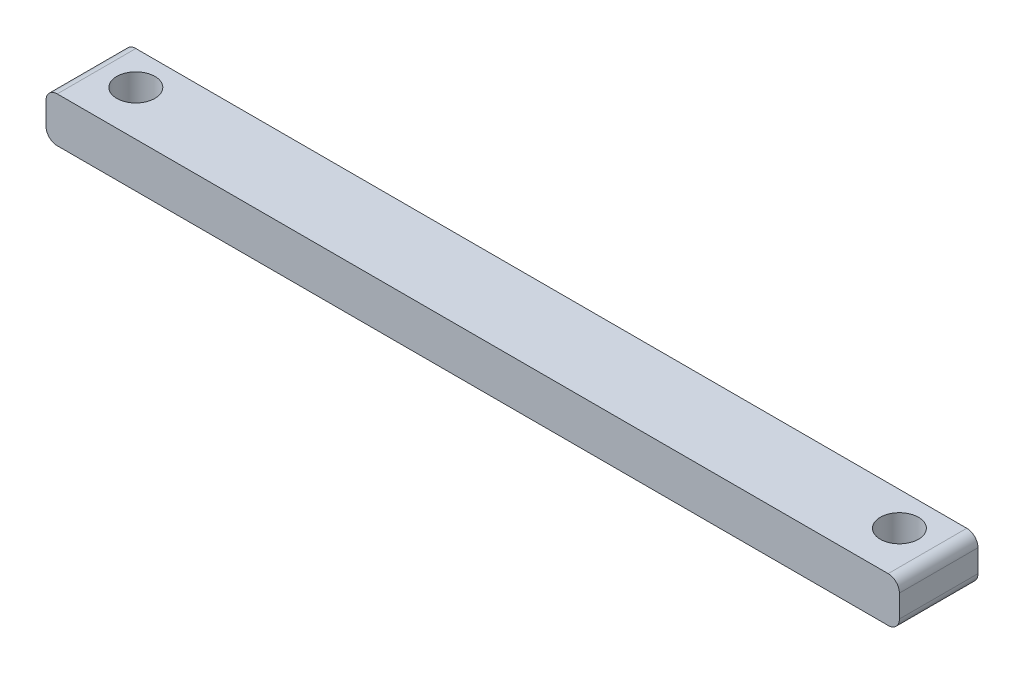
ISO-10303-21;
HEADER;
FILE_DESCRIPTION(('STEP AP214'),'2;1');
FILE_NAME('part.step','',(''),(''),'','','');
FILE_SCHEMA(('AUTOMOTIVE_DESIGN { 1 0 10303 214 1 1 1 1 }'));
ENDSEC;
DATA;
#1=APPLICATION_CONTEXT('core data for automotive mechanical design processes');
#2=APPLICATION_PROTOCOL_DEFINITION('international standard','automotive_design',2000,#1);
#3=PRODUCT_CONTEXT('',#1,'mechanical');
#4=PRODUCT('Part','Part','',(#3));
#5=PRODUCT_RELATED_PRODUCT_CATEGORY('part','',(#4));
#6=PRODUCT_DEFINITION_FORMATION('','',#4);
#7=PRODUCT_DEFINITION_CONTEXT('part definition',#1,'design');
#8=PRODUCT_DEFINITION('design','',#6,#7);
#9=PRODUCT_DEFINITION_SHAPE('','',#8);
#10=(LENGTH_UNIT() NAMED_UNIT(*) SI_UNIT(.MILLI.,.METRE.));
#11=(NAMED_UNIT(*) PLANE_ANGLE_UNIT() SI_UNIT($,.RADIAN.));
#12=(NAMED_UNIT(*) SI_UNIT($,.STERADIAN.) SOLID_ANGLE_UNIT());
#13=UNCERTAINTY_MEASURE_WITH_UNIT(LENGTH_MEASURE(1.E-05),#10,'distance_accuracy_value','');
#14=(GEOMETRIC_REPRESENTATION_CONTEXT(3) GLOBAL_UNCERTAINTY_ASSIGNED_CONTEXT((#13)) GLOBAL_UNIT_ASSIGNED_CONTEXT((#10,
#11,#12)) REPRESENTATION_CONTEXT('',''));
#15=CARTESIAN_POINT('',(0.,0.,0.));
#16=DIRECTION('',(0.,0.,1.));
#17=DIRECTION('',(1.,0.,0.));
#18=AXIS2_PLACEMENT_3D('',#15,#16,#17);
#19=CARTESIAN_POINT('',(18.4999999999993,46.1498986999913,1173.75015195));
#20=DIRECTION('',(0.,0.,1.));
#21=DIRECTION('',(1.,0.,0.));
#22=AXIS2_PLACEMENT_3D('',#19,#20,#21);
#23=CYLINDRICAL_SURFACE('',#22,0.5);
#24=CARTESIAN_POINT('',(18.4999999999993,46.1498986999913,1173.75015195));
#25=DIRECTION('',(0.,0.,-1.));
#26=DIRECTION('',(1.,0.,0.));
#27=AXIS2_PLACEMENT_3D('',#24,#25,#26);
#28=CIRCLE('',#27,0.5);
#29=CARTESIAN_POINT('',(18.4999999999993,46.6498986999913,1173.75015195));
#30=VERTEX_POINT('',#29);
#31=CARTESIAN_POINT('',(18.9999999999993,46.1498986999913,1173.75015195));
#32=VERTEX_POINT('',#31);
#33=EDGE_CURVE('E81',#30,#32,#28,.T.);
#34=ORIENTED_EDGE('',*,*,#33,.F.);
#35=DIRECTION('',(0.,0.,-1.));
#36=VECTOR('',#35,1.);
#37=CARTESIAN_POINT('',(18.4999999999993,46.6498986999913,1173.75015195));
#38=LINE('',#37,#36);
#39=CARTESIAN_POINT('',(18.4999999999993,46.6498986999913,1177.25015195));
#40=VERTEX_POINT('',#39);
#41=EDGE_CURVE('E174',#40,#30,#38,.T.);
#42=ORIENTED_EDGE('',*,*,#41,.F.);
#43=CARTESIAN_POINT('',(18.4999999999993,46.1498986999913,1177.25015195));
#44=DIRECTION('',(0.,0.,1.));
#45=DIRECTION('',(1.,0.,0.));
#46=AXIS2_PLACEMENT_3D('',#43,#44,#45);
#47=CIRCLE('',#46,0.5);
#48=CARTESIAN_POINT('',(18.9999999999993,46.1498986999913,1177.25015195));
#49=VERTEX_POINT('',#48);
#50=EDGE_CURVE('E28',#49,#40,#47,.T.);
#51=ORIENTED_EDGE('',*,*,#50,.F.);
#52=DIRECTION('',(0.,0.,1.));
#53=VECTOR('',#52,1.);
#54=CARTESIAN_POINT('',(18.9999999999993,46.1498986999913,1173.75015195));
#55=LINE('',#54,#53);
#56=EDGE_CURVE('E202',#32,#49,#55,.T.);
#57=ORIENTED_EDGE('',*,*,#56,.F.);
#58=EDGE_LOOP('',(#34,#42,#51,#57));
#59=FACE_BOUND('',#58,.T.);
#60=ADVANCED_FACE('F17',(#59),#23,.T.);
#61=CARTESIAN_POINT('',(-18.5000000000007,46.149898699991,1173.75015195));
#62=DIRECTION('',(0.,0.,1.));
#63=DIRECTION('',(1.,0.,0.));
#64=AXIS2_PLACEMENT_3D('',#61,#62,#63);
#65=CYLINDRICAL_SURFACE('',#64,0.5);
#66=CARTESIAN_POINT('',(-18.5000000000007,46.149898699991,1173.75015195));
#67=DIRECTION('',(0.,0.,-1.));
#68=DIRECTION('',(1.,0.,0.));
#69=AXIS2_PLACEMENT_3D('',#66,#67,#68);
#70=CIRCLE('',#69,0.5);
#71=CARTESIAN_POINT('',(-19.0000000000007,46.149898699991,1173.75015195));
#72=VERTEX_POINT('',#71);
#73=CARTESIAN_POINT('',(-18.5000000000007,46.649898699991,1173.75015195));
#74=VERTEX_POINT('',#73);
#75=EDGE_CURVE('E127',#72,#74,#70,.T.);
#76=ORIENTED_EDGE('',*,*,#75,.F.);
#77=DIRECTION('',(0.,0.,-1.));
#78=VECTOR('',#77,1.);
#79=CARTESIAN_POINT('',(-19.0000000000007,46.149898699991,1173.75015195));
#80=LINE('',#79,#78);
#81=CARTESIAN_POINT('',(-19.0000000000007,46.149898699991,1177.25015195));
#82=VERTEX_POINT('',#81);
#83=EDGE_CURVE('E147',#82,#72,#80,.T.);
#84=ORIENTED_EDGE('',*,*,#83,.F.);
#85=CARTESIAN_POINT('',(-18.5000000000007,46.149898699991,1177.25015195));
#86=DIRECTION('',(0.,0.,1.));
#87=DIRECTION('',(1.,0.,0.));
#88=AXIS2_PLACEMENT_3D('',#85,#86,#87);
#89=CIRCLE('',#88,0.5);
#90=CARTESIAN_POINT('',(-18.5000000000007,46.649898699991,1177.25015195));
#91=VERTEX_POINT('',#90);
#92=EDGE_CURVE('E11',#91,#82,#89,.T.);
#93=ORIENTED_EDGE('',*,*,#92,.F.);
#94=DIRECTION('',(0.,0.,1.));
#95=VECTOR('',#94,1.);
#96=CARTESIAN_POINT('',(-18.5000000000007,46.649898699991,1173.75015195));
#97=LINE('',#96,#95);
#98=EDGE_CURVE('E170',#74,#91,#97,.T.);
#99=ORIENTED_EDGE('',*,*,#98,.F.);
#100=EDGE_LOOP('',(#76,#84,#93,#99));
#101=FACE_BOUND('',#100,.T.);
#102=ADVANCED_FACE('F148',(#101),#65,.T.);
#103=CARTESIAN_POINT('',(18.4999999999993,45.1498986999913,1173.75015195));
#104=DIRECTION('',(0.,0.,1.));
#105=DIRECTION('',(1.,0.,0.));
#106=AXIS2_PLACEMENT_3D('',#103,#104,#105);
#107=CYLINDRICAL_SURFACE('',#106,0.5);
#108=CARTESIAN_POINT('',(18.4999999999993,45.1498986999913,1173.75015195));
#109=DIRECTION('',(0.,0.,-1.));
#110=DIRECTION('',(1.,0.,0.));
#111=AXIS2_PLACEMENT_3D('',#108,#109,#110);
#112=CIRCLE('',#111,0.5);
#113=CARTESIAN_POINT('',(18.9999999999993,45.1498986999913,1173.75015195));
#114=VERTEX_POINT('',#113);
#115=CARTESIAN_POINT('',(18.4999999999993,44.6498986999913,1173.75015195));
#116=VERTEX_POINT('',#115);
#117=EDGE_CURVE('E96',#114,#116,#112,.T.);
#118=ORIENTED_EDGE('',*,*,#117,.F.);
#119=DIRECTION('',(0.,0.,-1.));
#120=VECTOR('',#119,1.);
#121=CARTESIAN_POINT('',(18.9999999999993,45.1498986999913,1173.75015195));
#122=LINE('',#121,#120);
#123=CARTESIAN_POINT('',(18.9999999999993,45.1498986999913,1177.25015195));
#124=VERTEX_POINT('',#123);
#125=EDGE_CURVE('E191',#124,#114,#122,.T.);
#126=ORIENTED_EDGE('',*,*,#125,.F.);
#127=CARTESIAN_POINT('',(18.4999999999993,45.1498986999913,1177.25015195));
#128=DIRECTION('',(0.,0.,1.));
#129=DIRECTION('',(1.,0.,0.));
#130=AXIS2_PLACEMENT_3D('',#127,#128,#129);
#131=CIRCLE('',#130,0.5);
#132=CARTESIAN_POINT('',(18.4999999999993,44.6498986999913,1177.25015195));
#133=VERTEX_POINT('',#132);
#134=EDGE_CURVE('E181',#133,#124,#131,.T.);
#135=ORIENTED_EDGE('',*,*,#134,.F.);
#136=DIRECTION('',(0.,0.,1.));
#137=VECTOR('',#136,1.);
#138=CARTESIAN_POINT('',(18.4999999999993,44.6498986999913,1173.75015195));
#139=LINE('',#138,#137);
#140=EDGE_CURVE('E238',#116,#133,#139,.T.);
#141=ORIENTED_EDGE('',*,*,#140,.F.);
#142=EDGE_LOOP('',(#118,#126,#135,#141));
#143=FACE_BOUND('',#142,.T.);
#144=ADVANCED_FACE('F256',(#143),#107,.T.);
#145=CARTESIAN_POINT('',(-18.5000000000007,45.1498986999909,1173.75015195));
#146=DIRECTION('',(0.,0.,1.));
#147=DIRECTION('',(1.,0.,0.));
#148=AXIS2_PLACEMENT_3D('',#145,#146,#147);
#149=CYLINDRICAL_SURFACE('',#148,0.5);
#150=CARTESIAN_POINT('',(-18.5000000000007,45.1498986999909,1173.75015195));
#151=DIRECTION('',(0.,0.,-1.));
#152=DIRECTION('',(1.,0.,0.));
#153=AXIS2_PLACEMENT_3D('',#150,#151,#152);
#154=CIRCLE('',#153,0.5);
#155=CARTESIAN_POINT('',(-18.5000000000007,44.649898699991,1173.75015195));
#156=VERTEX_POINT('',#155);
#157=CARTESIAN_POINT('',(-19.0000000000007,45.1498986999909,1173.75015195));
#158=VERTEX_POINT('',#157);
#159=EDGE_CURVE('E114',#156,#158,#154,.T.);
#160=ORIENTED_EDGE('',*,*,#159,.F.);
#161=DIRECTION('',(0.,0.,-1.));
#162=VECTOR('',#161,1.);
#163=CARTESIAN_POINT('',(-18.5000000000007,44.649898699991,1173.75015195));
#164=LINE('',#163,#162);
#165=CARTESIAN_POINT('',(-18.5000000000007,44.649898699991,1177.25015195));
#166=VERTEX_POINT('',#165);
#167=EDGE_CURVE('E229',#166,#156,#164,.T.);
#168=ORIENTED_EDGE('',*,*,#167,.F.);
#169=CARTESIAN_POINT('',(-18.5000000000007,45.1498986999909,1177.25015195));
#170=DIRECTION('',(0.,0.,1.));
#171=DIRECTION('',(1.,0.,0.));
#172=AXIS2_PLACEMENT_3D('',#169,#170,#171);
#173=CIRCLE('',#172,0.5);
#174=CARTESIAN_POINT('',(-19.0000000000007,45.1498986999909,1177.25015195));
#175=VERTEX_POINT('',#174);
#176=EDGE_CURVE('E178',#175,#166,#173,.T.);
#177=ORIENTED_EDGE('',*,*,#176,.F.);
#178=DIRECTION('',(0.,0.,1.));
#179=VECTOR('',#178,1.);
#180=CARTESIAN_POINT('',(-19.0000000000007,45.1498986999909,1173.75015195));
#181=LINE('',#180,#179);
#182=EDGE_CURVE('E155',#158,#175,#181,.T.);
#183=ORIENTED_EDGE('',*,*,#182,.F.);
#184=EDGE_LOOP('',(#160,#168,#177,#183));
#185=FACE_BOUND('',#184,.T.);
#186=ADVANCED_FACE('F254',(#185),#149,.T.);
#187=CARTESIAN_POINT('',(-1.67262200459707E-13,-24.8501013000089,1177.25015195));
#188=DIRECTION('',(0.,0.,1.));
#189=DIRECTION('',(1.,0.,0.));
#190=AXIS2_PLACEMENT_3D('',#187,#188,#189);
#191=PLANE('',#190);
#192=DIRECTION('',(0.,1.,0.));
#193=VECTOR('',#192,1.);
#194=CARTESIAN_POINT('',(-19.0000000000007,44.649898699991,1177.25015195));
#195=LINE('',#194,#193);
#196=EDGE_CURVE('E142',#175,#82,#195,.T.);
#197=ORIENTED_EDGE('',*,*,#196,.F.);
#198=ORIENTED_EDGE('',*,*,#176,.T.);
#199=DIRECTION('',(-1.,0.,0.));
#200=VECTOR('',#199,1.);
#201=CARTESIAN_POINT('',(18.9999999999993,44.6498986999913,1177.25015195));
#202=LINE('',#201,#200);
#203=EDGE_CURVE('E228',#133,#166,#202,.T.);
#204=ORIENTED_EDGE('',*,*,#203,.F.);
#205=ORIENTED_EDGE('',*,*,#134,.T.);
#206=DIRECTION('',(0.,-1.,0.));
#207=VECTOR('',#206,1.);
#208=CARTESIAN_POINT('',(18.9999999999993,44.6498986999913,1177.25015195));
#209=LINE('',#208,#207);
#210=EDGE_CURVE('E21',#49,#124,#209,.T.);
#211=ORIENTED_EDGE('',*,*,#210,.F.);
#212=ORIENTED_EDGE('',*,*,#50,.T.);
#213=DIRECTION('',(1.,0.,0.));
#214=VECTOR('',#213,1.);
#215=CARTESIAN_POINT('',(18.9999999999993,46.6498986999913,1177.25015195));
#216=LINE('',#215,#214);
#217=EDGE_CURVE('E145',#91,#40,#216,.T.);
#218=ORIENTED_EDGE('',*,*,#217,.F.);
#219=ORIENTED_EDGE('',*,*,#92,.T.);
#220=EDGE_LOOP('',(#197,#198,#204,#205,#211,#212,#218,#219));
#221=FACE_BOUND('',#220,.T.);
#222=ADVANCED_FACE('F139',(#221),#191,.T.);
#223=CARTESIAN_POINT('',(-1.66526554584626E-13,-24.8501013000089,1173.75015195));
#224=DIRECTION('',(0.,0.,1.));
#225=DIRECTION('',(1.,0.,0.));
#226=AXIS2_PLACEMENT_3D('',#223,#224,#225);
#227=PLANE('',#226);
#228=DIRECTION('',(-1.,0.,0.));
#229=VECTOR('',#228,1.);
#230=CARTESIAN_POINT('',(18.9999999999993,44.6498986999913,1173.75015195));
#231=LINE('',#230,#229);
#232=EDGE_CURVE('E232',#116,#156,#231,.T.);
#233=ORIENTED_EDGE('',*,*,#232,.T.);
#234=ORIENTED_EDGE('',*,*,#159,.T.);
#235=DIRECTION('',(0.,1.,0.));
#236=VECTOR('',#235,1.);
#237=CARTESIAN_POINT('',(-19.0000000000007,44.649898699991,1173.75015195));
#238=LINE('',#237,#236);
#239=EDGE_CURVE('E163',#158,#72,#238,.T.);
#240=ORIENTED_EDGE('',*,*,#239,.T.);
#241=ORIENTED_EDGE('',*,*,#75,.T.);
#242=DIRECTION('',(1.,0.,0.));
#243=VECTOR('',#242,1.);
#244=CARTESIAN_POINT('',(18.9999999999993,46.6498986999913,1173.75015195));
#245=LINE('',#244,#243);
#246=EDGE_CURVE('E152',#74,#30,#245,.T.);
#247=ORIENTED_EDGE('',*,*,#246,.T.);
#248=ORIENTED_EDGE('',*,*,#33,.T.);
#249=DIRECTION('',(0.,-1.,0.));
#250=VECTOR('',#249,1.);
#251=CARTESIAN_POINT('',(18.9999999999993,44.6498986999913,1173.75015195));
#252=LINE('',#251,#250);
#253=EDGE_CURVE('E194',#32,#114,#252,.T.);
#254=ORIENTED_EDGE('',*,*,#253,.T.);
#255=ORIENTED_EDGE('',*,*,#117,.T.);
#256=EDGE_LOOP('',(#233,#234,#240,#241,#247,#248,#254,#255));
#257=FACE_BOUND('',#256,.T.);
#258=ADVANCED_FACE('F255',(#257),#227,.F.);
#259=CARTESIAN_POINT('',(18.9999999999993,46.6498986999913,1173.75015195));
#260=DIRECTION('',(0.,-1.,0.));
#261=DIRECTION('',(0.,0.,-1.));
#262=AXIS2_PLACEMENT_3D('',#259,#260,#261);
#263=PLANE('',#262);
#264=CARTESIAN_POINT('',(-17.0000000000007,46.649898699991,1175.25015195));
#265=DIRECTION('',(0.,1.,0.));
#266=DIRECTION('',(0.,0.,1.));
#267=AXIS2_PLACEMENT_3D('',#264,#265,#266);
#268=CIRCLE('',#267,0.84999999999999);
#269=CARTESIAN_POINT('',(-17.0000000000007,46.649898699991,1176.10015195));
#270=VERTEX_POINT('',#269);
#271=EDGE_CURVE('E188',#270,#270,#268,.T.);
#272=ORIENTED_EDGE('',*,*,#271,.F.);
#273=EDGE_LOOP('',(#272));
#274=FACE_BOUND('',#273,.T.);
#275=CARTESIAN_POINT('',(16.9999999999993,46.6498986999913,1175.25015195));
#276=DIRECTION('',(0.,1.,0.));
#277=DIRECTION('',(0.,0.,1.));
#278=AXIS2_PLACEMENT_3D('',#275,#276,#277);
#279=CIRCLE('',#278,0.84999999999999);
#280=CARTESIAN_POINT('',(16.9999999999993,46.6498986999913,1176.10015195));
#281=VERTEX_POINT('',#280);
#282=EDGE_CURVE('E167',#281,#281,#279,.T.);
#283=ORIENTED_EDGE('',*,*,#282,.F.);
#284=EDGE_LOOP('',(#283));
#285=FACE_BOUND('',#284,.T.);
#286=ORIENTED_EDGE('',*,*,#246,.F.);
#287=ORIENTED_EDGE('',*,*,#98,.T.);
#288=ORIENTED_EDGE('',*,*,#217,.T.);
#289=ORIENTED_EDGE('',*,*,#41,.T.);
#290=EDGE_LOOP('',(#286,#287,#288,#289));
#291=FACE_BOUND('',#290,.T.);
#292=ADVANCED_FACE('F215',(#274,#285,#291),#263,.F.);
#293=CARTESIAN_POINT('',(-19.0000000000007,44.649898699991,1173.75015195));
#294=DIRECTION('',(1.,0.,0.));
#295=DIRECTION('',(0.,1.,0.));
#296=AXIS2_PLACEMENT_3D('',#293,#294,#295);
#297=PLANE('',#296);
#298=ORIENTED_EDGE('',*,*,#239,.F.);
#299=ORIENTED_EDGE('',*,*,#182,.T.);
#300=ORIENTED_EDGE('',*,*,#196,.T.);
#301=ORIENTED_EDGE('',*,*,#83,.T.);
#302=EDGE_LOOP('',(#298,#299,#300,#301));
#303=FACE_BOUND('',#302,.T.);
#304=ADVANCED_FACE('F154',(#303),#297,.F.);
#305=CARTESIAN_POINT('',(18.9999999999993,44.6498986999913,1173.75015195));
#306=DIRECTION('',(0.,1.,0.));
#307=DIRECTION('',(1.,0.,0.));
#308=AXIS2_PLACEMENT_3D('',#305,#306,#307);
#309=PLANE('',#308);
#310=CARTESIAN_POINT('',(-17.0000000000007,44.649898699991,1175.25015195));
#311=DIRECTION('',(0.,1.,0.));
#312=DIRECTION('',(0.,0.,1.));
#313=AXIS2_PLACEMENT_3D('',#310,#311,#312);
#314=CIRCLE('',#313,0.84999999999999);
#315=CARTESIAN_POINT('',(-17.0000000000007,44.649898699991,1176.10015195));
#316=VERTEX_POINT('',#315);
#317=EDGE_CURVE('E190',#316,#316,#314,.T.);
#318=ORIENTED_EDGE('',*,*,#317,.T.);
#319=EDGE_LOOP('',(#318));
#320=FACE_BOUND('',#319,.T.);
#321=CARTESIAN_POINT('',(16.9999999999993,44.6498986999913,1175.25015195));
#322=DIRECTION('',(0.,1.,0.));
#323=DIRECTION('',(0.,0.,1.));
#324=AXIS2_PLACEMENT_3D('',#321,#322,#323);
#325=CIRCLE('',#324,0.84999999999999);
#326=CARTESIAN_POINT('',(16.9999999999993,44.6498986999913,1176.10015195));
#327=VERTEX_POINT('',#326);
#328=EDGE_CURVE('E171',#327,#327,#325,.T.);
#329=ORIENTED_EDGE('',*,*,#328,.T.);
#330=EDGE_LOOP('',(#329));
#331=FACE_BOUND('',#330,.T.);
#332=ORIENTED_EDGE('',*,*,#203,.T.);
#333=ORIENTED_EDGE('',*,*,#167,.T.);
#334=ORIENTED_EDGE('',*,*,#232,.F.);
#335=ORIENTED_EDGE('',*,*,#140,.T.);
#336=EDGE_LOOP('',(#332,#333,#334,#335));
#337=FACE_BOUND('',#336,.T.);
#338=ADVANCED_FACE('F19',(#320,#331,#337),#309,.F.);
#339=CARTESIAN_POINT('',(18.9999999999993,44.6498986999913,1173.75015195));
#340=DIRECTION('',(-1.,0.,0.));
#341=DIRECTION('',(0.,0.,1.));
#342=AXIS2_PLACEMENT_3D('',#339,#340,#341);
#343=PLANE('',#342);
#344=ORIENTED_EDGE('',*,*,#210,.T.);
#345=ORIENTED_EDGE('',*,*,#125,.T.);
#346=ORIENTED_EDGE('',*,*,#253,.F.);
#347=ORIENTED_EDGE('',*,*,#56,.T.);
#348=EDGE_LOOP('',(#344,#345,#346,#347));
#349=FACE_BOUND('',#348,.T.);
#350=ADVANCED_FACE('F208',(#349),#343,.F.);
#351=CARTESIAN_POINT('',(-17.0000000000007,46.649898699991,1175.25015195));
#352=DIRECTION('',(0.,1.,0.));
#353=DIRECTION('',(0.,0.,1.));
#354=AXIS2_PLACEMENT_3D('',#351,#352,#353);
#355=CYLINDRICAL_SURFACE('',#354,0.84999999999999);
#356=ORIENTED_EDGE('',*,*,#271,.T.);
#357=EDGE_LOOP('',(#356));
#358=FACE_BOUND('',#357,.T.);
#359=ORIENTED_EDGE('',*,*,#317,.F.);
#360=EDGE_LOOP('',(#359));
#361=FACE_BOUND('',#360,.T.);
#362=ADVANCED_FACE('F483',(#358,#361),#355,.F.);
#363=CARTESIAN_POINT('',(16.9999999999993,46.6498986999913,1175.25015195));
#364=DIRECTION('',(0.,1.,0.));
#365=DIRECTION('',(0.,0.,1.));
#366=AXIS2_PLACEMENT_3D('',#363,#364,#365);
#367=CYLINDRICAL_SURFACE('',#366,0.84999999999999);
#368=ORIENTED_EDGE('',*,*,#282,.T.);
#369=EDGE_LOOP('',(#368));
#370=FACE_BOUND('',#369,.T.);
#371=ORIENTED_EDGE('',*,*,#328,.F.);
#372=EDGE_LOOP('',(#371));
#373=FACE_BOUND('',#372,.T.);
#374=ADVANCED_FACE('F278',(#370,#373),#367,.F.);
#375=CLOSED_SHELL('',(#60,#102,#144,#186,#222,#258,#292,#304,#338,#350,#362,#374));
#376=MANIFOLD_SOLID_BREP('B1',#375);
#377=ADVANCED_BREP_SHAPE_REPRESENTATION('',(#18,#376),#14);
#378=SHAPE_DEFINITION_REPRESENTATION(#9,#377);
ENDSEC;
END-ISO-10303-21;
